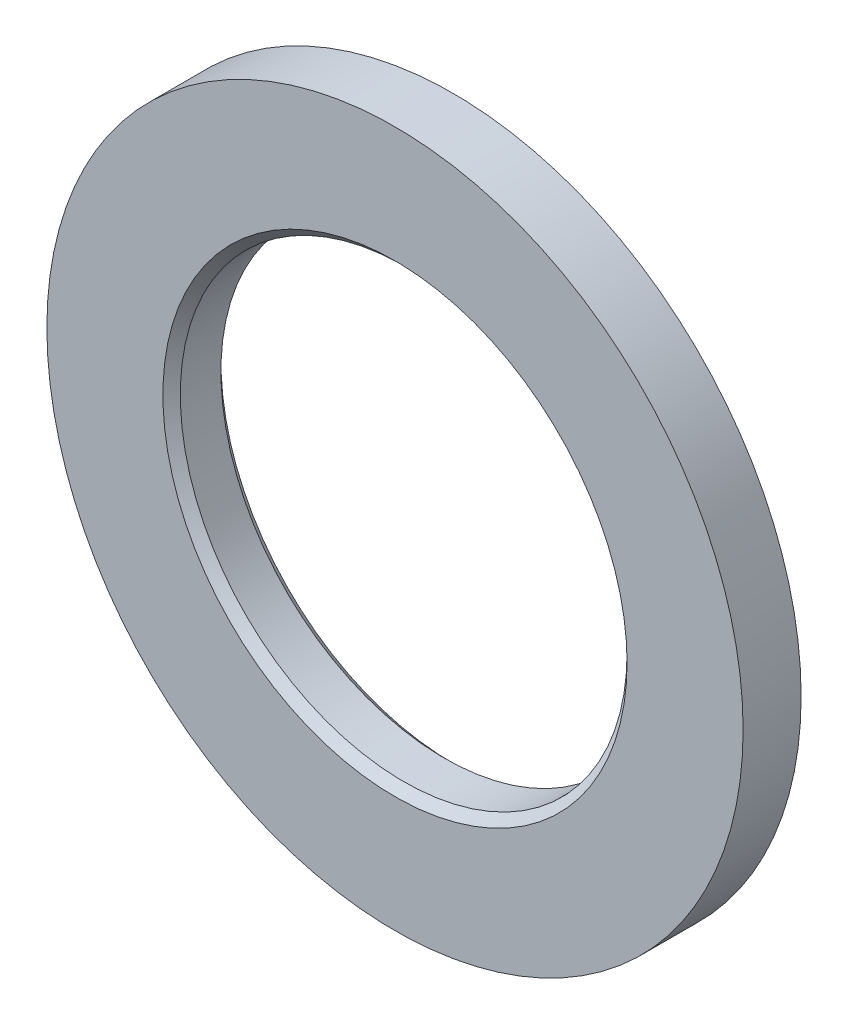
ISO-10303-21;
HEADER;
FILE_DESCRIPTION(('STEP AP214'),'2;1');
FILE_NAME('part.step','',(''),(''),'','','');
FILE_SCHEMA(('AUTOMOTIVE_DESIGN { 1 0 10303 214 1 1 1 1 }'));
ENDSEC;
DATA;
#1=APPLICATION_CONTEXT('core data for automotive mechanical design processes');
#2=APPLICATION_PROTOCOL_DEFINITION('international standard','automotive_design',2000,#1);
#3=PRODUCT_CONTEXT('',#1,'mechanical');
#4=PRODUCT('Part','Part','',(#3));
#5=PRODUCT_RELATED_PRODUCT_CATEGORY('part','',(#4));
#6=PRODUCT_DEFINITION_FORMATION('','',#4);
#7=PRODUCT_DEFINITION_CONTEXT('part definition',#1,'design');
#8=PRODUCT_DEFINITION('design','',#6,#7);
#9=PRODUCT_DEFINITION_SHAPE('','',#8);
#10=(LENGTH_UNIT() NAMED_UNIT(*) SI_UNIT(.MILLI.,.METRE.));
#11=(NAMED_UNIT(*) PLANE_ANGLE_UNIT() SI_UNIT($,.RADIAN.));
#12=(NAMED_UNIT(*) SI_UNIT($,.STERADIAN.) SOLID_ANGLE_UNIT());
#13=UNCERTAINTY_MEASURE_WITH_UNIT(LENGTH_MEASURE(1.E-05),#10,'distance_accuracy_value','');
#14=(GEOMETRIC_REPRESENTATION_CONTEXT(3) GLOBAL_UNCERTAINTY_ASSIGNED_CONTEXT((#13)) GLOBAL_UNIT_ASSIGNED_CONTEXT((#10,
#11,#12)) REPRESENTATION_CONTEXT('',''));
#15=CARTESIAN_POINT('',(0.,0.,0.));
#16=DIRECTION('',(0.,0.,1.));
#17=DIRECTION('',(1.,0.,0.));
#18=AXIS2_PLACEMENT_3D('',#15,#16,#17);
#19=CARTESIAN_POINT('',(0.,0.,5.));
#20=DIRECTION('',(0.,0.,-1.));
#21=DIRECTION('',(-1.,0.,0.));
#22=AXIS2_PLACEMENT_3D('',#19,#20,#21);
#23=CYLINDRICAL_SURFACE('',#22,30.);
#24=CARTESIAN_POINT('',(0.,0.,5.));
#25=DIRECTION('',(0.,0.,1.));
#26=DIRECTION('',(1.,0.,0.));
#27=AXIS2_PLACEMENT_3D('',#24,#25,#26);
#28=CIRCLE('',#27,30.);
#29=CARTESIAN_POINT('',(30.,0.,5.));
#30=VERTEX_POINT('',#29);
#31=EDGE_CURVE('E10',#30,#30,#28,.T.);
#32=ORIENTED_EDGE('',*,*,#31,.F.);
#33=EDGE_LOOP('',(#32));
#34=FACE_BOUND('',#33,.T.);
#35=CARTESIAN_POINT('',(0.,0.,0.));
#36=DIRECTION('',(0.,0.,1.));
#37=DIRECTION('',(1.,0.,0.));
#38=AXIS2_PLACEMENT_3D('',#35,#36,#37);
#39=CIRCLE('',#38,30.);
#40=CARTESIAN_POINT('',(30.,0.,0.));
#41=VERTEX_POINT('',#40);
#42=EDGE_CURVE('E35',#41,#41,#39,.T.);
#43=ORIENTED_EDGE('',*,*,#42,.T.);
#44=EDGE_LOOP('',(#43));
#45=FACE_BOUND('',#44,.T.);
#46=ADVANCED_FACE('F32',(#34,#45),#23,.T.);
#47=CARTESIAN_POINT('',(0.,0.,5.));
#48=DIRECTION('',(0.,0.,1.));
#49=DIRECTION('',(1.,0.,0.));
#50=AXIS2_PLACEMENT_3D('',#47,#48,#49);
#51=PLANE('',#50);
#52=CARTESIAN_POINT('',(0.,0.,5.));
#53=DIRECTION('',(0.,0.,1.));
#54=DIRECTION('',(1.,0.,0.));
#55=AXIS2_PLACEMENT_3D('',#52,#53,#54);
#56=CIRCLE('',#55,20.);
#57=CARTESIAN_POINT('',(20.,0.,5.));
#58=VERTEX_POINT('',#57);
#59=EDGE_CURVE('E42',#58,#58,#56,.T.);
#60=ORIENTED_EDGE('',*,*,#59,.F.);
#61=EDGE_LOOP('',(#60));
#62=FACE_BOUND('',#61,.T.);
#63=ORIENTED_EDGE('',*,*,#31,.T.);
#64=EDGE_LOOP('',(#63));
#65=FACE_BOUND('',#64,.T.);
#66=ADVANCED_FACE('F77',(#62,#65),#51,.T.);
#67=CARTESIAN_POINT('',(0.,0.,0.));
#68=DIRECTION('',(0.,0.,1.));
#69=DIRECTION('',(1.,0.,0.));
#70=AXIS2_PLACEMENT_3D('',#67,#68,#69);
#71=PLANE('',#70);
#72=CARTESIAN_POINT('',(0.,0.,0.));
#73=DIRECTION('',(0.,0.,1.));
#74=DIRECTION('',(1.,0.,0.));
#75=AXIS2_PLACEMENT_3D('',#72,#73,#74);
#76=CIRCLE('',#75,20.);
#77=CARTESIAN_POINT('',(20.,0.,0.));
#78=VERTEX_POINT('',#77);
#79=EDGE_CURVE('E52',#78,#78,#76,.T.);
#80=ORIENTED_EDGE('',*,*,#79,.T.);
#81=EDGE_LOOP('',(#80));
#82=FACE_BOUND('',#81,.T.);
#83=ORIENTED_EDGE('',*,*,#42,.F.);
#84=EDGE_LOOP('',(#83));
#85=FACE_BOUND('',#84,.T.);
#86=ADVANCED_FACE('F56',(#82,#85),#71,.F.);
#87=CARTESIAN_POINT('',(0.,0.,0.));
#88=DIRECTION('',(0.,0.,1.));
#89=DIRECTION('',(1.,0.,0.));
#90=AXIS2_PLACEMENT_3D('',#87,#88,#89);
#91=CYLINDRICAL_SURFACE('',#90,19.25);
#92=CARTESIAN_POINT('',(0.,0.,0.750000000000001));
#93=DIRECTION('',(0.,0.,1.));
#94=DIRECTION('',(1.,0.,0.));
#95=AXIS2_PLACEMENT_3D('',#92,#93,#94);
#96=CIRCLE('',#95,19.25);
#97=CARTESIAN_POINT('',(19.25,0.,0.750000000000001));
#98=VERTEX_POINT('',#97);
#99=EDGE_CURVE('E49',#98,#98,#96,.T.);
#100=ORIENTED_EDGE('',*,*,#99,.F.);
#101=EDGE_LOOP('',(#100));
#102=FACE_BOUND('',#101,.T.);
#103=CARTESIAN_POINT('',(0.,0.,4.25));
#104=DIRECTION('',(0.,0.,1.));
#105=DIRECTION('',(1.,0.,0.));
#106=AXIS2_PLACEMENT_3D('',#103,#104,#105);
#107=CIRCLE('',#106,19.25);
#108=CARTESIAN_POINT('',(19.25,0.,4.25));
#109=VERTEX_POINT('',#108);
#110=EDGE_CURVE('E46',#109,#109,#107,.T.);
#111=ORIENTED_EDGE('',*,*,#110,.T.);
#112=EDGE_LOOP('',(#111));
#113=FACE_BOUND('',#112,.T.);
#114=ADVANCED_FACE('F66',(#102,#113),#91,.F.);
#115=CARTESIAN_POINT('',(0.,0.,5.));
#116=DIRECTION('',(0.,0.,1.));
#117=DIRECTION('',(1.,0.,0.));
#118=AXIS2_PLACEMENT_3D('',#115,#116,#117);
#119=CONICAL_SURFACE('',#118,20.,0.785398163397449);
#120=ORIENTED_EDGE('',*,*,#110,.F.);
#121=EDGE_LOOP('',(#120));
#122=FACE_BOUND('',#121,.T.);
#123=ORIENTED_EDGE('',*,*,#59,.T.);
#124=EDGE_LOOP('',(#123));
#125=FACE_BOUND('',#124,.T.);
#126=ADVANCED_FACE('F62',(#122,#125),#119,.F.);
#127=CARTESIAN_POINT('',(0.,0.,0.750000000000001));
#128=DIRECTION('',(0.,0.,-1.));
#129=DIRECTION('',(-1.,0.,0.));
#130=AXIS2_PLACEMENT_3D('',#127,#128,#129);
#131=CONICAL_SURFACE('',#130,19.25,0.785398163397448);
#132=ORIENTED_EDGE('',*,*,#79,.F.);
#133=EDGE_LOOP('',(#132));
#134=FACE_BOUND('',#133,.T.);
#135=ORIENTED_EDGE('',*,*,#99,.T.);
#136=EDGE_LOOP('',(#135));
#137=FACE_BOUND('',#136,.T.);
#138=ADVANCED_FACE('F59',(#134,#137),#131,.F.);
#139=CLOSED_SHELL('',(#46,#66,#86,#114,#126,#138));
#140=MANIFOLD_SOLID_BREP('B2',#139);
#141=ADVANCED_BREP_SHAPE_REPRESENTATION('',(#18,#140),#14);
#142=SHAPE_DEFINITION_REPRESENTATION(#9,#141);
ENDSEC;
END-ISO-10303-21;
